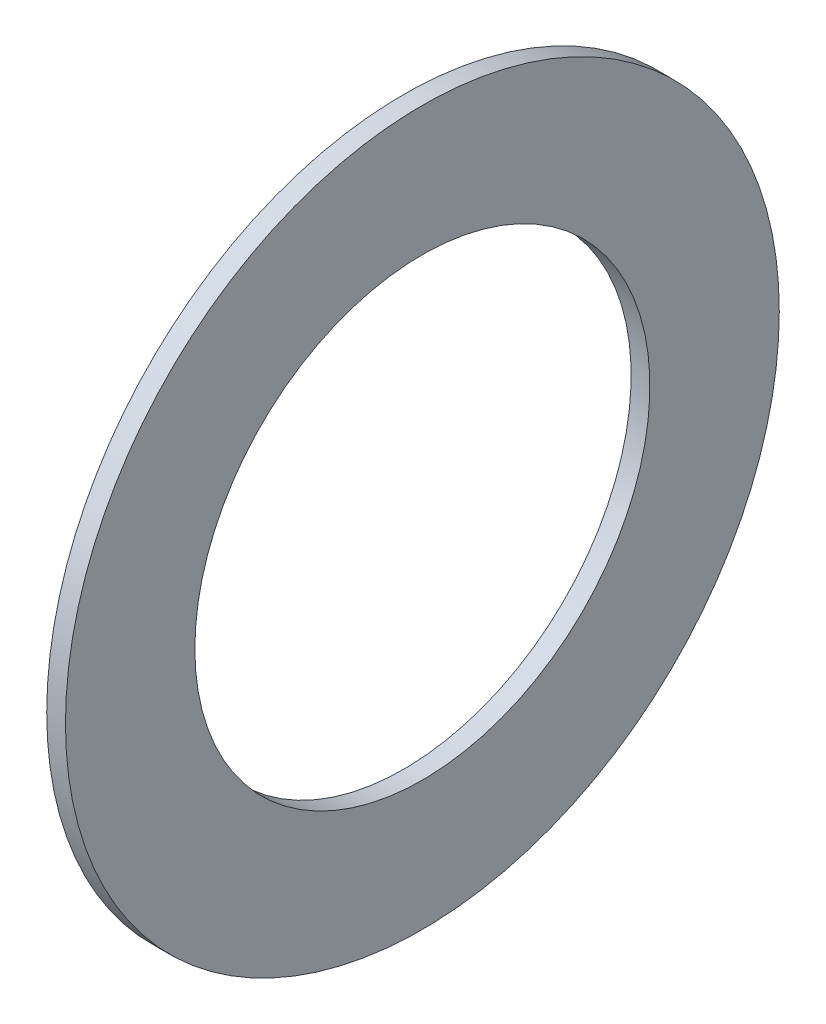
ISO-10303-21;
HEADER;
FILE_DESCRIPTION(('STEP AP214'),'2;1');
FILE_NAME('part.step','',(''),(''),'','','');
FILE_SCHEMA(('AUTOMOTIVE_DESIGN { 1 0 10303 214 1 1 1 1 }'));
ENDSEC;
DATA;
#1=APPLICATION_CONTEXT('core data for automotive mechanical design processes');
#2=APPLICATION_PROTOCOL_DEFINITION('international standard','automotive_design',2000,#1);
#3=PRODUCT_CONTEXT('',#1,'mechanical');
#4=PRODUCT('Part','Part','',(#3));
#5=PRODUCT_RELATED_PRODUCT_CATEGORY('part','',(#4));
#6=PRODUCT_DEFINITION_FORMATION('','',#4);
#7=PRODUCT_DEFINITION_CONTEXT('part definition',#1,'design');
#8=PRODUCT_DEFINITION('design','',#6,#7);
#9=PRODUCT_DEFINITION_SHAPE('','',#8);
#10=(LENGTH_UNIT() NAMED_UNIT(*) SI_UNIT(.MILLI.,.METRE.));
#11=(NAMED_UNIT(*) PLANE_ANGLE_UNIT() SI_UNIT($,.RADIAN.));
#12=(NAMED_UNIT(*) SI_UNIT($,.STERADIAN.) SOLID_ANGLE_UNIT());
#13=UNCERTAINTY_MEASURE_WITH_UNIT(LENGTH_MEASURE(1.E-05),#10,'distance_accuracy_value','');
#14=(GEOMETRIC_REPRESENTATION_CONTEXT(3) GLOBAL_UNCERTAINTY_ASSIGNED_CONTEXT((#13)) GLOBAL_UNIT_ASSIGNED_CONTEXT((#10,
#11,#12)) REPRESENTATION_CONTEXT('',''));
#15=CARTESIAN_POINT('',(0.,0.,0.));
#16=DIRECTION('',(0.,0.,1.));
#17=DIRECTION('',(1.,0.,0.));
#18=AXIS2_PLACEMENT_3D('',#15,#16,#17);
#19=CARTESIAN_POINT('',(-0.21,0.,0.));
#20=DIRECTION('',(1.,0.,0.));
#21=DIRECTION('',(0.,0.,-1.));
#22=AXIS2_PLACEMENT_3D('',#19,#20,#21);
#23=PLANE('',#22);
#24=CARTESIAN_POINT('',(-0.21,0.,0.));
#25=DIRECTION('',(-1.,0.,0.));
#26=DIRECTION('',(0.,0.,1.));
#27=AXIS2_PLACEMENT_3D('',#24,#25,#26);
#28=CIRCLE('',#27,5.1);
#29=CARTESIAN_POINT('',(-0.21,0.,5.1));
#30=VERTEX_POINT('',#29);
#31=EDGE_CURVE('E26',#30,#30,#28,.F.);
#32=ORIENTED_EDGE('',*,*,#31,.T.);
#33=EDGE_LOOP('',(#32));
#34=FACE_BOUND('',#33,.T.);
#35=CARTESIAN_POINT('',(-0.21,0.,0.));
#36=DIRECTION('',(-1.,0.,0.));
#37=DIRECTION('',(0.,0.,1.));
#38=AXIS2_PLACEMENT_3D('',#35,#36,#37);
#39=CIRCLE('',#38,8.);
#40=CARTESIAN_POINT('',(-0.21,0.,8.));
#41=VERTEX_POINT('',#40);
#42=EDGE_CURVE('E17',#41,#41,#39,.F.);
#43=ORIENTED_EDGE('',*,*,#42,.F.);
#44=EDGE_LOOP('',(#43));
#45=FACE_BOUND('',#44,.T.);
#46=ADVANCED_FACE('F14',(#34,#45),#23,.F.);
#47=CARTESIAN_POINT('',(0.21,0.,0.));
#48=DIRECTION('',(-1.,0.,0.));
#49=DIRECTION('',(0.,0.,1.));
#50=AXIS2_PLACEMENT_3D('',#47,#48,#49);
#51=CYLINDRICAL_SURFACE('',#50,8.);
#52=ORIENTED_EDGE('',*,*,#42,.T.);
#53=EDGE_LOOP('',(#52));
#54=FACE_BOUND('',#53,.T.);
#55=CARTESIAN_POINT('',(0.21,0.,0.));
#56=DIRECTION('',(-1.,0.,0.));
#57=DIRECTION('',(0.,0.,1.));
#58=AXIS2_PLACEMENT_3D('',#55,#56,#57);
#59=CIRCLE('',#58,8.);
#60=CARTESIAN_POINT('',(0.21,0.,8.));
#61=VERTEX_POINT('',#60);
#62=EDGE_CURVE('E21',#61,#61,#59,.F.);
#63=ORIENTED_EDGE('',*,*,#62,.F.);
#64=EDGE_LOOP('',(#63));
#65=FACE_BOUND('',#64,.T.);
#66=ADVANCED_FACE('F34',(#54,#65),#51,.T.);
#67=CARTESIAN_POINT('',(0.21,0.,0.));
#68=DIRECTION('',(-1.,0.,0.));
#69=DIRECTION('',(0.,0.,1.));
#70=AXIS2_PLACEMENT_3D('',#67,#68,#69);
#71=CYLINDRICAL_SURFACE('',#70,5.1);
#72=CARTESIAN_POINT('',(0.21,0.,0.));
#73=DIRECTION('',(-1.,0.,0.));
#74=DIRECTION('',(0.,0.,1.));
#75=AXIS2_PLACEMENT_3D('',#72,#73,#74);
#76=CIRCLE('',#75,5.1);
#77=CARTESIAN_POINT('',(0.21,0.,5.1));
#78=VERTEX_POINT('',#77);
#79=EDGE_CURVE('E10',#78,#78,#76,.T.);
#80=ORIENTED_EDGE('',*,*,#79,.F.);
#81=EDGE_LOOP('',(#80));
#82=FACE_BOUND('',#81,.T.);
#83=ORIENTED_EDGE('',*,*,#31,.F.);
#84=EDGE_LOOP('',(#83));
#85=FACE_BOUND('',#84,.T.);
#86=ADVANCED_FACE('F42',(#82,#85),#71,.F.);
#87=CARTESIAN_POINT('',(0.21,0.,0.));
#88=DIRECTION('',(1.,0.,0.));
#89=DIRECTION('',(0.,0.,-1.));
#90=AXIS2_PLACEMENT_3D('',#87,#88,#89);
#91=PLANE('',#90);
#92=ORIENTED_EDGE('',*,*,#79,.T.);
#93=EDGE_LOOP('',(#92));
#94=FACE_BOUND('',#93,.T.);
#95=ORIENTED_EDGE('',*,*,#62,.T.);
#96=EDGE_LOOP('',(#95));
#97=FACE_BOUND('',#96,.T.);
#98=ADVANCED_FACE('F43',(#94,#97),#91,.T.);
#99=CLOSED_SHELL('',(#46,#66,#86,#98));
#100=MANIFOLD_SOLID_BREP('B1',#99);
#101=ADVANCED_BREP_SHAPE_REPRESENTATION('',(#18,#100),#14);
#102=SHAPE_DEFINITION_REPRESENTATION(#9,#101);
ENDSEC;
END-ISO-10303-21;
